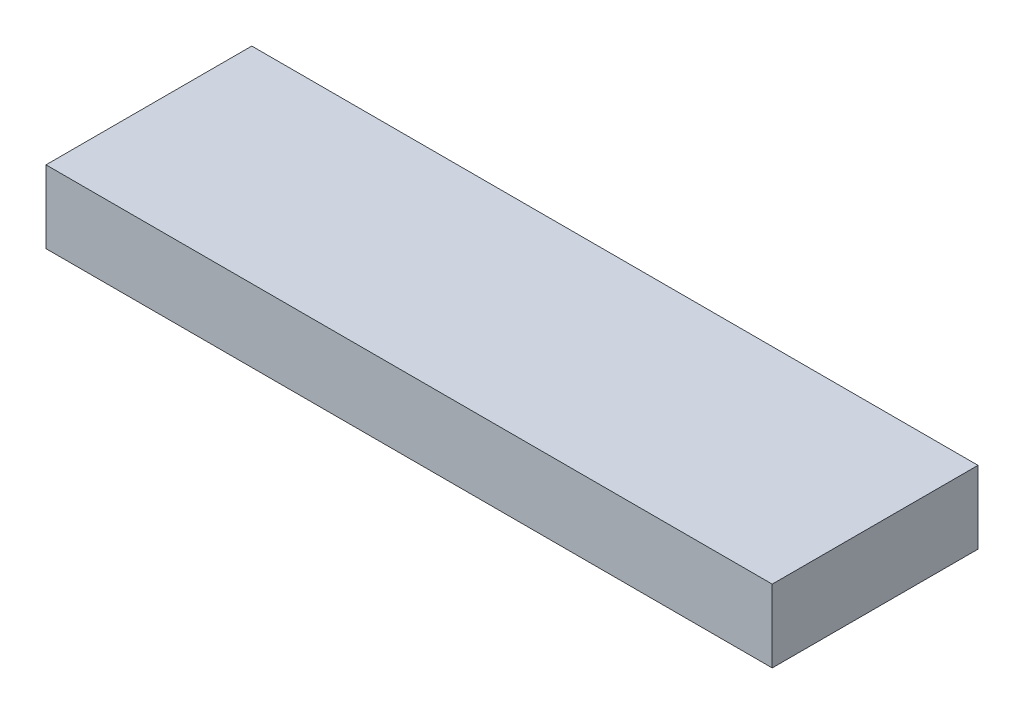
ISO-10303-21;
HEADER;
FILE_DESCRIPTION(('STEP AP214'),'2;1');
FILE_NAME('part.step','',(''),(''),'','','');
FILE_SCHEMA(('AUTOMOTIVE_DESIGN { 1 0 10303 214 1 1 1 1 }'));
ENDSEC;
DATA;
#1=APPLICATION_CONTEXT('core data for automotive mechanical design processes');
#2=APPLICATION_PROTOCOL_DEFINITION('international standard','automotive_design',2000,#1);
#3=PRODUCT_CONTEXT('',#1,'mechanical');
#4=PRODUCT('Part','Part','',(#3));
#5=PRODUCT_RELATED_PRODUCT_CATEGORY('part','',(#4));
#6=PRODUCT_DEFINITION_FORMATION('','',#4);
#7=PRODUCT_DEFINITION_CONTEXT('part definition',#1,'design');
#8=PRODUCT_DEFINITION('design','',#6,#7);
#9=PRODUCT_DEFINITION_SHAPE('','',#8);
#10=(LENGTH_UNIT() NAMED_UNIT(*) SI_UNIT(.MILLI.,.METRE.));
#11=(NAMED_UNIT(*) PLANE_ANGLE_UNIT() SI_UNIT($,.RADIAN.));
#12=(NAMED_UNIT(*) SI_UNIT($,.STERADIAN.) SOLID_ANGLE_UNIT());
#13=UNCERTAINTY_MEASURE_WITH_UNIT(LENGTH_MEASURE(1.E-05),#10,'distance_accuracy_value','');
#14=(GEOMETRIC_REPRESENTATION_CONTEXT(3) GLOBAL_UNCERTAINTY_ASSIGNED_CONTEXT((#13)) GLOBAL_UNIT_ASSIGNED_CONTEXT((#10,
#11,#12)) REPRESENTATION_CONTEXT('',''));
#15=CARTESIAN_POINT('',(0.,0.,0.));
#16=DIRECTION('',(0.,0.,1.));
#17=DIRECTION('',(1.,0.,0.));
#18=AXIS2_PLACEMENT_3D('',#15,#16,#17);
#19=CARTESIAN_POINT('',(0.,0.,0.));
#20=DIRECTION('',(0.,0.,-1.));
#21=DIRECTION('',(-1.,0.,0.));
#22=AXIS2_PLACEMENT_3D('',#19,#20,#21);
#23=PLANE('',#22);
#24=DIRECTION('',(0.,-1.,0.));
#25=VECTOR('',#24,1.);
#26=CARTESIAN_POINT('',(0.,0.,0.));
#27=LINE('',#26,#25);
#28=CARTESIAN_POINT('',(0.,0.06,0.));
#29=VERTEX_POINT('',#28);
#30=CARTESIAN_POINT('',(0.,0.,0.));
#31=VERTEX_POINT('',#30);
#32=EDGE_CURVE('E179',#29,#31,#27,.T.);
#33=ORIENTED_EDGE('',*,*,#32,.F.);
#34=DIRECTION('',(-1.,0.,0.));
#35=VECTOR('',#34,1.);
#36=CARTESIAN_POINT('',(0.,0.06,0.));
#37=LINE('',#36,#35);
#38=CARTESIAN_POINT('',(0.6,0.06,0.));
#39=VERTEX_POINT('',#38);
#40=EDGE_CURVE('E331',#39,#29,#37,.T.);
#41=ORIENTED_EDGE('',*,*,#40,.F.);
#42=DIRECTION('',(0.,1.,0.));
#43=VECTOR('',#42,1.);
#44=CARTESIAN_POINT('',(0.6,0.,0.));
#45=LINE('',#44,#43);
#46=CARTESIAN_POINT('',(0.6,0.,0.));
#47=VERTEX_POINT('',#46);
#48=EDGE_CURVE('E329',#47,#39,#45,.T.);
#49=ORIENTED_EDGE('',*,*,#48,.F.);
#50=DIRECTION('',(1.,0.,0.));
#51=VECTOR('',#50,1.);
#52=CARTESIAN_POINT('',(0.,0.,0.));
#53=LINE('',#52,#51);
#54=EDGE_CURVE('E327',#31,#47,#53,.T.);
#55=ORIENTED_EDGE('',*,*,#54,.F.);
#56=EDGE_LOOP('',(#33,#41,#49,#55));
#57=FACE_BOUND('',#56,.T.);
#58=DIRECTION('',(-1.,0.,0.));
#59=VECTOR('',#58,1.);
#60=CARTESIAN_POINT('',(0.0150695996096264,0.0450077471621841,0.));
#61=LINE('',#60,#59);
#62=CARTESIAN_POINT('',(0.116007256687764,0.0450077471621841,0.));
#63=VERTEX_POINT('',#62);
#64=CARTESIAN_POINT('',(0.0150695996096264,0.0450077471621841,0.));
#65=VERTEX_POINT('',#64);
#66=EDGE_CURVE('E297',#63,#65,#61,.T.);
#67=ORIENTED_EDGE('',*,*,#66,.T.);
#68=DIRECTION('',(0.,-1.,0.));
#69=VECTOR('',#68,1.);
#70=CARTESIAN_POINT('',(0.0150695996096264,0.0450077471621841,0.));
#71=LINE('',#70,#69);
#72=CARTESIAN_POINT('',(0.0150695996096264,0.0157641268872097,0.));
#73=VERTEX_POINT('',#72);
#74=EDGE_CURVE('E292',#65,#73,#71,.T.);
#75=ORIENTED_EDGE('',*,*,#74,.T.);
#76=DIRECTION('',(1.,0.,0.));
#77=VECTOR('',#76,1.);
#78=CARTESIAN_POINT('',(0.0150695996096264,0.0157641268872097,0.));
#79=LINE('',#78,#77);
#80=CARTESIAN_POINT('',(0.116007256687764,0.0157641268872097,0.));
#81=VERTEX_POINT('',#80);
#82=EDGE_CURVE('E309',#73,#81,#79,.T.);
#83=ORIENTED_EDGE('',*,*,#82,.T.);
#84=DIRECTION('',(0.,1.,0.));
#85=VECTOR('',#84,1.);
#86=CARTESIAN_POINT('',(0.116007256687764,0.0450077471621841,0.));
#87=LINE('',#86,#85);
#88=EDGE_CURVE('E312',#81,#63,#87,.T.);
#89=ORIENTED_EDGE('',*,*,#88,.T.);
#90=EDGE_LOOP('',(#67,#75,#83,#89));
#91=FACE_BOUND('',#90,.T.);
#92=DIRECTION('',(-1.,0.,0.));
#93=VECTOR('',#92,1.);
#94=CARTESIAN_POINT('',(0.153740960268376,0.0459510897516995,0.));
#95=LINE('',#94,#93);
#96=CARTESIAN_POINT('',(0.254678617346513,0.0459510897516995,0.));
#97=VERTEX_POINT('',#96);
#98=CARTESIAN_POINT('',(0.153740960268376,0.0459510897516995,0.));
#99=VERTEX_POINT('',#98);
#100=EDGE_CURVE('E263',#97,#99,#95,.T.);
#101=ORIENTED_EDGE('',*,*,#100,.T.);
#102=DIRECTION('',(0.,-1.,0.));
#103=VECTOR('',#102,1.);
#104=CARTESIAN_POINT('',(0.153740960268376,0.0459510897516995,0.));
#105=LINE('',#104,#103);
#106=CARTESIAN_POINT('',(0.153740960268376,0.016707469476725,0.));
#107=VERTEX_POINT('',#106);
#108=EDGE_CURVE('E258',#99,#107,#105,.T.);
#109=ORIENTED_EDGE('',*,*,#108,.T.);
#110=DIRECTION('',(1.,0.,0.));
#111=VECTOR('',#110,1.);
#112=CARTESIAN_POINT('',(0.153740960268376,0.016707469476725,0.));
#113=LINE('',#112,#111);
#114=CARTESIAN_POINT('',(0.254678617346513,0.016707469476725,0.));
#115=VERTEX_POINT('',#114);
#116=EDGE_CURVE('E275',#107,#115,#113,.T.);
#117=ORIENTED_EDGE('',*,*,#116,.T.);
#118=DIRECTION('',(0.,1.,0.));
#119=VECTOR('',#118,1.);
#120=CARTESIAN_POINT('',(0.254678617346513,0.0459510897516995,0.));
#121=LINE('',#120,#119);
#122=EDGE_CURVE('E278',#115,#97,#121,.T.);
#123=ORIENTED_EDGE('',*,*,#122,.T.);
#124=EDGE_LOOP('',(#101,#109,#117,#123));
#125=FACE_BOUND('',#124,.T.);
#126=DIRECTION('',(-1.,0.,0.));
#127=VECTOR('',#126,1.);
#128=CARTESIAN_POINT('',(0.341466135581921,0.0431210619831535,0.));
#129=LINE('',#128,#127);
#130=CARTESIAN_POINT('',(0.442403792660059,0.0431210619831535,0.));
#131=VERTEX_POINT('',#130);
#132=CARTESIAN_POINT('',(0.341466135581921,0.0431210619831535,0.));
#133=VERTEX_POINT('',#132);
#134=EDGE_CURVE('E232',#131,#133,#129,.T.);
#135=ORIENTED_EDGE('',*,*,#134,.T.);
#136=DIRECTION('',(0.,-1.,0.));
#137=VECTOR('',#136,1.);
#138=CARTESIAN_POINT('',(0.341466135581921,0.0431210619831535,0.));
#139=LINE('',#138,#137);
#140=CARTESIAN_POINT('',(0.341466135581921,0.0138774417081791,0.));
#141=VERTEX_POINT('',#140);
#142=EDGE_CURVE('E56',#133,#141,#139,.T.);
#143=ORIENTED_EDGE('',*,*,#142,.T.);
#144=DIRECTION('',(1.,0.,0.));
#145=VECTOR('',#144,1.);
#146=CARTESIAN_POINT('',(0.341466135581921,0.0138774417081791,0.));
#147=LINE('',#146,#145);
#148=CARTESIAN_POINT('',(0.442403792660059,0.0138774417081791,0.));
#149=VERTEX_POINT('',#148);
#150=EDGE_CURVE('E243',#141,#149,#147,.T.);
#151=ORIENTED_EDGE('',*,*,#150,.T.);
#152=DIRECTION('',(0.,1.,0.));
#153=VECTOR('',#152,1.);
#154=CARTESIAN_POINT('',(0.442403792660059,0.0431210619831535,0.));
#155=LINE('',#154,#153);
#156=EDGE_CURVE('E246',#149,#131,#155,.T.);
#157=ORIENTED_EDGE('',*,*,#156,.T.);
#158=EDGE_LOOP('',(#135,#143,#151,#157));
#159=FACE_BOUND('',#158,.T.);
#160=DIRECTION('',(-1.,0.,0.));
#161=VECTOR('',#160,1.);
#162=CARTESIAN_POINT('',(0.480137496240671,0.0440644045726689,0.));
#163=LINE('',#162,#161);
#164=CARTESIAN_POINT('',(0.581075153318808,0.0440644045726689,0.));
#165=VERTEX_POINT('',#164);
#166=CARTESIAN_POINT('',(0.480137496240671,0.0440644045726689,0.));
#167=VERTEX_POINT('',#166);
#168=EDGE_CURVE('E202',#165,#167,#163,.T.);
#169=ORIENTED_EDGE('',*,*,#168,.T.);
#170=DIRECTION('',(0.,-1.,0.));
#171=VECTOR('',#170,1.);
#172=CARTESIAN_POINT('',(0.480137496240671,0.0440644045726689,0.));
#173=LINE('',#172,#171);
#174=CARTESIAN_POINT('',(0.480137496240671,0.0148207842976945,0.));
#175=VERTEX_POINT('',#174);
#176=EDGE_CURVE('E48',#167,#175,#173,.T.);
#177=ORIENTED_EDGE('',*,*,#176,.T.);
#178=DIRECTION('',(1.,0.,0.));
#179=VECTOR('',#178,1.);
#180=CARTESIAN_POINT('',(0.480137496240671,0.0148207842976945,0.));
#181=LINE('',#180,#179);
#182=CARTESIAN_POINT('',(0.581075153318808,0.0148207842976945,0.));
#183=VERTEX_POINT('',#182);
#184=EDGE_CURVE('E213',#175,#183,#181,.T.);
#185=ORIENTED_EDGE('',*,*,#184,.T.);
#186=DIRECTION('',(0.,1.,0.));
#187=VECTOR('',#186,1.);
#188=CARTESIAN_POINT('',(0.581075153318808,0.0440644045726689,0.));
#189=LINE('',#188,#187);
#190=EDGE_CURVE('E216',#183,#165,#189,.T.);
#191=ORIENTED_EDGE('',*,*,#190,.T.);
#192=EDGE_LOOP('',(#169,#177,#185,#191));
#193=FACE_BOUND('',#192,.T.);
#194=ADVANCED_FACE('F33',(#57,#91,#125,#159,#193),#23,.T.);
#195=CARTESIAN_POINT('',(0.,0.,0.15));
#196=DIRECTION('',(1.,0.,0.));
#197=DIRECTION('',(0.,0.,-1.));
#198=AXIS2_PLACEMENT_3D('',#195,#196,#197);
#199=PLANE('',#198);
#200=ORIENTED_EDGE('',*,*,#32,.T.);
#201=DIRECTION('',(0.,0.,-1.));
#202=VECTOR('',#201,1.);
#203=CARTESIAN_POINT('',(0.,0.,0.15));
#204=LINE('',#203,#202);
#205=CARTESIAN_POINT('',(0.,0.,0.17));
#206=VERTEX_POINT('',#205);
#207=EDGE_CURVE('E11',#206,#31,#204,.T.);
#208=ORIENTED_EDGE('',*,*,#207,.F.);
#209=DIRECTION('',(0.,-1.,0.));
#210=VECTOR('',#209,1.);
#211=CARTESIAN_POINT('',(0.,0.06,0.17));
#212=LINE('',#211,#210);
#213=CARTESIAN_POINT('',(0.,0.06,0.17));
#214=VERTEX_POINT('',#213);
#215=EDGE_CURVE('E177',#214,#206,#212,.T.);
#216=ORIENTED_EDGE('',*,*,#215,.F.);
#217=DIRECTION('',(0.,0.,-1.));
#218=VECTOR('',#217,1.);
#219=CARTESIAN_POINT('',(0.,0.06,0.15));
#220=LINE('',#219,#218);
#221=EDGE_CURVE('E333',#214,#29,#220,.T.);
#222=ORIENTED_EDGE('',*,*,#221,.T.);
#223=EDGE_LOOP('',(#200,#208,#216,#222));
#224=FACE_BOUND('',#223,.T.);
#225=ADVANCED_FACE('F35',(#224),#199,.F.);
#226=CARTESIAN_POINT('',(0.,0.,0.15));
#227=DIRECTION('',(0.,1.,0.));
#228=DIRECTION('',(0.,0.,1.));
#229=AXIS2_PLACEMENT_3D('',#226,#227,#228);
#230=PLANE('',#229);
#231=ORIENTED_EDGE('',*,*,#54,.T.);
#232=DIRECTION('',(0.,0.,-1.));
#233=VECTOR('',#232,1.);
#234=CARTESIAN_POINT('',(0.6,0.,0.15));
#235=LINE('',#234,#233);
#236=CARTESIAN_POINT('',(0.6,0.,0.17));
#237=VERTEX_POINT('',#236);
#238=EDGE_CURVE('E41',#237,#47,#235,.T.);
#239=ORIENTED_EDGE('',*,*,#238,.F.);
#240=DIRECTION('',(1.,0.,0.));
#241=VECTOR('',#240,1.);
#242=CARTESIAN_POINT('',(0.,0.,0.17));
#243=LINE('',#242,#241);
#244=EDGE_CURVE('E182',#206,#237,#243,.T.);
#245=ORIENTED_EDGE('',*,*,#244,.F.);
#246=ORIENTED_EDGE('',*,*,#207,.T.);
#247=EDGE_LOOP('',(#231,#239,#245,#246));
#248=FACE_BOUND('',#247,.T.);
#249=ADVANCED_FACE('F183',(#248),#230,.F.);
#250=CARTESIAN_POINT('',(0.6,0.,0.15));
#251=DIRECTION('',(-1.,0.,0.));
#252=DIRECTION('',(0.,0.,1.));
#253=AXIS2_PLACEMENT_3D('',#250,#251,#252);
#254=PLANE('',#253);
#255=ORIENTED_EDGE('',*,*,#48,.T.);
#256=DIRECTION('',(0.,0.,-1.));
#257=VECTOR('',#256,1.);
#258=CARTESIAN_POINT('',(0.6,0.06,0.15));
#259=LINE('',#258,#257);
#260=CARTESIAN_POINT('',(0.6,0.06,0.17));
#261=VERTEX_POINT('',#260);
#262=EDGE_CURVE('E335',#261,#39,#259,.T.);
#263=ORIENTED_EDGE('',*,*,#262,.F.);
#264=DIRECTION('',(0.,1.,0.));
#265=VECTOR('',#264,1.);
#266=CARTESIAN_POINT('',(0.6,0.06,0.17));
#267=LINE('',#266,#265);
#268=EDGE_CURVE('E188',#237,#261,#267,.T.);
#269=ORIENTED_EDGE('',*,*,#268,.F.);
#270=ORIENTED_EDGE('',*,*,#238,.T.);
#271=EDGE_LOOP('',(#255,#263,#269,#270));
#272=FACE_BOUND('',#271,.T.);
#273=ADVANCED_FACE('F339',(#272),#254,.F.);
#274=CARTESIAN_POINT('',(0.,0.06,0.15));
#275=DIRECTION('',(0.,-1.,0.));
#276=DIRECTION('',(0.,0.,-1.));
#277=AXIS2_PLACEMENT_3D('',#274,#275,#276);
#278=PLANE('',#277);
#279=ORIENTED_EDGE('',*,*,#40,.T.);
#280=ORIENTED_EDGE('',*,*,#221,.F.);
#281=DIRECTION('',(-1.,0.,0.));
#282=VECTOR('',#281,1.);
#283=CARTESIAN_POINT('',(0.,0.06,0.17));
#284=LINE('',#283,#282);
#285=EDGE_CURVE('E193',#261,#214,#284,.T.);
#286=ORIENTED_EDGE('',*,*,#285,.F.);
#287=ORIENTED_EDGE('',*,*,#262,.T.);
#288=EDGE_LOOP('',(#279,#280,#286,#287));
#289=FACE_BOUND('',#288,.T.);
#290=ADVANCED_FACE('F344',(#289),#278,.F.);
#291=CARTESIAN_POINT('',(0.0150695996096264,0.0450077471621841,0.15));
#292=DIRECTION('',(1.,0.,0.));
#293=DIRECTION('',(0.,0.,-1.));
#294=AXIS2_PLACEMENT_3D('',#291,#292,#293);
#295=PLANE('',#294);
#296=ORIENTED_EDGE('',*,*,#74,.F.);
#297=DIRECTION('',(0.,0.,-1.));
#298=VECTOR('',#297,1.);
#299=CARTESIAN_POINT('',(0.0150695996096264,0.0450077471621841,0.15));
#300=LINE('',#299,#298);
#301=CARTESIAN_POINT('',(0.0150695996096264,0.0450077471621841,0.15));
#302=VERTEX_POINT('',#301);
#303=EDGE_CURVE('E306',#302,#65,#300,.T.);
#304=ORIENTED_EDGE('',*,*,#303,.F.);
#305=DIRECTION('',(0.,-1.,0.));
#306=VECTOR('',#305,1.);
#307=CARTESIAN_POINT('',(0.0150695996096264,0.0450077471621841,0.15));
#308=LINE('',#307,#306);
#309=CARTESIAN_POINT('',(0.0150695996096264,0.0157641268872097,0.15));
#310=VERTEX_POINT('',#309);
#311=EDGE_CURVE('E293',#302,#310,#308,.T.);
#312=ORIENTED_EDGE('',*,*,#311,.T.);
#313=DIRECTION('',(0.,0.,-1.));
#314=VECTOR('',#313,1.);
#315=CARTESIAN_POINT('',(0.0150695996096264,0.0157641268872097,0.15));
#316=LINE('',#315,#314);
#317=EDGE_CURVE('E323',#310,#73,#316,.T.);
#318=ORIENTED_EDGE('',*,*,#317,.T.);
#319=EDGE_LOOP('',(#296,#304,#312,#318));
#320=FACE_BOUND('',#319,.T.);
#321=ADVANCED_FACE('F346',(#320),#295,.T.);
#322=CARTESIAN_POINT('',(0.0150695996096264,0.0157641268872097,0.15));
#323=DIRECTION('',(0.,1.,0.));
#324=DIRECTION('',(0.,0.,1.));
#325=AXIS2_PLACEMENT_3D('',#322,#323,#324);
#326=PLANE('',#325);
#327=ORIENTED_EDGE('',*,*,#82,.F.);
#328=ORIENTED_EDGE('',*,*,#317,.F.);
#329=DIRECTION('',(1.,0.,0.));
#330=VECTOR('',#329,1.);
#331=CARTESIAN_POINT('',(0.0150695996096264,0.0157641268872097,0.15));
#332=LINE('',#331,#330);
#333=CARTESIAN_POINT('',(0.116007256687764,0.0157641268872097,0.15));
#334=VERTEX_POINT('',#333);
#335=EDGE_CURVE('E296',#310,#334,#332,.T.);
#336=ORIENTED_EDGE('',*,*,#335,.T.);
#337=DIRECTION('',(0.,0.,-1.));
#338=VECTOR('',#337,1.);
#339=CARTESIAN_POINT('',(0.116007256687764,0.0157641268872097,0.15));
#340=LINE('',#339,#338);
#341=EDGE_CURVE('E321',#334,#81,#340,.T.);
#342=ORIENTED_EDGE('',*,*,#341,.T.);
#343=EDGE_LOOP('',(#327,#328,#336,#342));
#344=FACE_BOUND('',#343,.T.);
#345=ADVANCED_FACE('F353',(#344),#326,.T.);
#346=CARTESIAN_POINT('',(0.116007256687764,0.0450077471621841,0.15));
#347=DIRECTION('',(-1.,0.,0.));
#348=DIRECTION('',(0.,0.,1.));
#349=AXIS2_PLACEMENT_3D('',#346,#347,#348);
#350=PLANE('',#349);
#351=ORIENTED_EDGE('',*,*,#88,.F.);
#352=ORIENTED_EDGE('',*,*,#341,.F.);
#353=DIRECTION('',(0.,1.,0.));
#354=VECTOR('',#353,1.);
#355=CARTESIAN_POINT('',(0.116007256687764,0.0450077471621841,0.15));
#356=LINE('',#355,#354);
#357=CARTESIAN_POINT('',(0.116007256687764,0.0450077471621841,0.15));
#358=VERTEX_POINT('',#357);
#359=EDGE_CURVE('E300',#334,#358,#356,.T.);
#360=ORIENTED_EDGE('',*,*,#359,.T.);
#361=DIRECTION('',(0.,0.,-1.));
#362=VECTOR('',#361,1.);
#363=CARTESIAN_POINT('',(0.116007256687764,0.0450077471621841,0.15));
#364=LINE('',#363,#362);
#365=EDGE_CURVE('E319',#358,#63,#364,.T.);
#366=ORIENTED_EDGE('',*,*,#365,.T.);
#367=EDGE_LOOP('',(#351,#352,#360,#366));
#368=FACE_BOUND('',#367,.T.);
#369=ADVANCED_FACE('F366',(#368),#350,.T.);
#370=CARTESIAN_POINT('',(0.0150695996096264,0.0450077471621841,0.15));
#371=DIRECTION('',(0.,-1.,0.));
#372=DIRECTION('',(0.,0.,-1.));
#373=AXIS2_PLACEMENT_3D('',#370,#371,#372);
#374=PLANE('',#373);
#375=ORIENTED_EDGE('',*,*,#66,.F.);
#376=ORIENTED_EDGE('',*,*,#365,.F.);
#377=DIRECTION('',(-1.,0.,0.));
#378=VECTOR('',#377,1.);
#379=CARTESIAN_POINT('',(0.0150695996096264,0.0450077471621841,0.15));
#380=LINE('',#379,#378);
#381=EDGE_CURVE('E303',#358,#302,#380,.T.);
#382=ORIENTED_EDGE('',*,*,#381,.T.);
#383=ORIENTED_EDGE('',*,*,#303,.T.);
#384=EDGE_LOOP('',(#375,#376,#382,#383));
#385=FACE_BOUND('',#384,.T.);
#386=ADVANCED_FACE('F370',(#385),#374,.T.);
#387=CARTESIAN_POINT('',(0.153740960268376,0.0459510897516995,0.15));
#388=DIRECTION('',(1.,0.,0.));
#389=DIRECTION('',(0.,0.,-1.));
#390=AXIS2_PLACEMENT_3D('',#387,#388,#389);
#391=PLANE('',#390);
#392=ORIENTED_EDGE('',*,*,#108,.F.);
#393=DIRECTION('',(0.,0.,-1.));
#394=VECTOR('',#393,1.);
#395=CARTESIAN_POINT('',(0.153740960268376,0.0459510897516995,0.15));
#396=LINE('',#395,#394);
#397=CARTESIAN_POINT('',(0.153740960268376,0.0459510897516995,0.15));
#398=VERTEX_POINT('',#397);
#399=EDGE_CURVE('E272',#398,#99,#396,.T.);
#400=ORIENTED_EDGE('',*,*,#399,.F.);
#401=DIRECTION('',(0.,-1.,0.));
#402=VECTOR('',#401,1.);
#403=CARTESIAN_POINT('',(0.153740960268376,0.0459510897516995,0.15));
#404=LINE('',#403,#402);
#405=CARTESIAN_POINT('',(0.153740960268376,0.016707469476725,0.15));
#406=VERTEX_POINT('',#405);
#407=EDGE_CURVE('E259',#398,#406,#404,.T.);
#408=ORIENTED_EDGE('',*,*,#407,.T.);
#409=DIRECTION('',(0.,0.,-1.));
#410=VECTOR('',#409,1.);
#411=CARTESIAN_POINT('',(0.153740960268376,0.016707469476725,0.15));
#412=LINE('',#411,#410);
#413=EDGE_CURVE('E289',#406,#107,#412,.T.);
#414=ORIENTED_EDGE('',*,*,#413,.T.);
#415=EDGE_LOOP('',(#392,#400,#408,#414));
#416=FACE_BOUND('',#415,.T.);
#417=ADVANCED_FACE('F374',(#416),#391,.T.);
#418=CARTESIAN_POINT('',(0.153740960268376,0.016707469476725,0.15));
#419=DIRECTION('',(0.,1.,0.));
#420=DIRECTION('',(0.,0.,1.));
#421=AXIS2_PLACEMENT_3D('',#418,#419,#420);
#422=PLANE('',#421);
#423=ORIENTED_EDGE('',*,*,#116,.F.);
#424=ORIENTED_EDGE('',*,*,#413,.F.);
#425=DIRECTION('',(1.,0.,0.));
#426=VECTOR('',#425,1.);
#427=CARTESIAN_POINT('',(0.153740960268376,0.016707469476725,0.15));
#428=LINE('',#427,#426);
#429=CARTESIAN_POINT('',(0.254678617346513,0.016707469476725,0.15));
#430=VERTEX_POINT('',#429);
#431=EDGE_CURVE('E262',#406,#430,#428,.T.);
#432=ORIENTED_EDGE('',*,*,#431,.T.);
#433=DIRECTION('',(0.,0.,-1.));
#434=VECTOR('',#433,1.);
#435=CARTESIAN_POINT('',(0.254678617346513,0.016707469476725,0.15));
#436=LINE('',#435,#434);
#437=EDGE_CURVE('E287',#430,#115,#436,.T.);
#438=ORIENTED_EDGE('',*,*,#437,.T.);
#439=EDGE_LOOP('',(#423,#424,#432,#438));
#440=FACE_BOUND('',#439,.T.);
#441=ADVANCED_FACE('F378',(#440),#422,.T.);
#442=CARTESIAN_POINT('',(0.254678617346513,0.0459510897516995,0.15));
#443=DIRECTION('',(-1.,0.,0.));
#444=DIRECTION('',(0.,0.,1.));
#445=AXIS2_PLACEMENT_3D('',#442,#443,#444);
#446=PLANE('',#445);
#447=ORIENTED_EDGE('',*,*,#122,.F.);
#448=ORIENTED_EDGE('',*,*,#437,.F.);
#449=DIRECTION('',(0.,1.,0.));
#450=VECTOR('',#449,1.);
#451=CARTESIAN_POINT('',(0.254678617346513,0.0459510897516995,0.15));
#452=LINE('',#451,#450);
#453=CARTESIAN_POINT('',(0.254678617346513,0.0459510897516995,0.15));
#454=VERTEX_POINT('',#453);
#455=EDGE_CURVE('E266',#430,#454,#452,.T.);
#456=ORIENTED_EDGE('',*,*,#455,.T.);
#457=DIRECTION('',(0.,0.,-1.));
#458=VECTOR('',#457,1.);
#459=CARTESIAN_POINT('',(0.254678617346513,0.0459510897516995,0.15));
#460=LINE('',#459,#458);
#461=EDGE_CURVE('E285',#454,#97,#460,.T.);
#462=ORIENTED_EDGE('',*,*,#461,.T.);
#463=EDGE_LOOP('',(#447,#448,#456,#462));
#464=FACE_BOUND('',#463,.T.);
#465=ADVANCED_FACE('F382',(#464),#446,.T.);
#466=CARTESIAN_POINT('',(0.153740960268376,0.0459510897516995,0.15));
#467=DIRECTION('',(0.,-1.,0.));
#468=DIRECTION('',(0.,0.,-1.));
#469=AXIS2_PLACEMENT_3D('',#466,#467,#468);
#470=PLANE('',#469);
#471=ORIENTED_EDGE('',*,*,#100,.F.);
#472=ORIENTED_EDGE('',*,*,#461,.F.);
#473=DIRECTION('',(-1.,0.,0.));
#474=VECTOR('',#473,1.);
#475=CARTESIAN_POINT('',(0.153740960268376,0.0459510897516995,0.15));
#476=LINE('',#475,#474);
#477=EDGE_CURVE('E269',#454,#398,#476,.T.);
#478=ORIENTED_EDGE('',*,*,#477,.T.);
#479=ORIENTED_EDGE('',*,*,#399,.T.);
#480=EDGE_LOOP('',(#471,#472,#478,#479));
#481=FACE_BOUND('',#480,.T.);
#482=ADVANCED_FACE('F386',(#481),#470,.T.);
#483=CARTESIAN_POINT('',(0.341466135581921,0.0431210619831535,0.15));
#484=DIRECTION('',(1.,0.,0.));
#485=DIRECTION('',(0.,0.,-1.));
#486=AXIS2_PLACEMENT_3D('',#483,#484,#485);
#487=PLANE('',#486);
#488=ORIENTED_EDGE('',*,*,#142,.F.);
#489=DIRECTION('',(0.,0.,-1.));
#490=VECTOR('',#489,1.);
#491=CARTESIAN_POINT('',(0.341466135581921,0.0431210619831535,0.15));
#492=LINE('',#491,#490);
#493=CARTESIAN_POINT('',(0.341466135581921,0.0431210619831535,0.15));
#494=VERTEX_POINT('',#493);
#495=EDGE_CURVE('E241',#494,#133,#492,.T.);
#496=ORIENTED_EDGE('',*,*,#495,.F.);
#497=DIRECTION('',(0.,-1.,0.));
#498=VECTOR('',#497,1.);
#499=CARTESIAN_POINT('',(0.341466135581921,0.0431210619831535,0.15));
#500=LINE('',#499,#498);
#501=CARTESIAN_POINT('',(0.341466135581921,0.0138774417081791,0.15));
#502=VERTEX_POINT('',#501);
#503=EDGE_CURVE('E228',#494,#502,#500,.T.);
#504=ORIENTED_EDGE('',*,*,#503,.T.);
#505=DIRECTION('',(0.,0.,-1.));
#506=VECTOR('',#505,1.);
#507=CARTESIAN_POINT('',(0.341466135581921,0.0138774417081791,0.15));
#508=LINE('',#507,#506);
#509=EDGE_CURVE('E256',#502,#141,#508,.T.);
#510=ORIENTED_EDGE('',*,*,#509,.T.);
#511=EDGE_LOOP('',(#488,#496,#504,#510));
#512=FACE_BOUND('',#511,.T.);
#513=ADVANCED_FACE('F390',(#512),#487,.T.);
#514=CARTESIAN_POINT('',(0.341466135581921,0.0138774417081791,0.15));
#515=DIRECTION('',(0.,1.,0.));
#516=DIRECTION('',(0.,0.,1.));
#517=AXIS2_PLACEMENT_3D('',#514,#515,#516);
#518=PLANE('',#517);
#519=ORIENTED_EDGE('',*,*,#150,.F.);
#520=ORIENTED_EDGE('',*,*,#509,.F.);
#521=DIRECTION('',(1.,0.,0.));
#522=VECTOR('',#521,1.);
#523=CARTESIAN_POINT('',(0.341466135581921,0.0138774417081791,0.15));
#524=LINE('',#523,#522);
#525=CARTESIAN_POINT('',(0.442403792660059,0.0138774417081791,0.15));
#526=VERTEX_POINT('',#525);
#527=EDGE_CURVE('E231',#502,#526,#524,.T.);
#528=ORIENTED_EDGE('',*,*,#527,.T.);
#529=DIRECTION('',(0.,0.,-1.));
#530=VECTOR('',#529,1.);
#531=CARTESIAN_POINT('',(0.442403792660059,0.0138774417081791,0.15));
#532=LINE('',#531,#530);
#533=EDGE_CURVE('E254',#526,#149,#532,.T.);
#534=ORIENTED_EDGE('',*,*,#533,.T.);
#535=EDGE_LOOP('',(#519,#520,#528,#534));
#536=FACE_BOUND('',#535,.T.);
#537=ADVANCED_FACE('F394',(#536),#518,.T.);
#538=CARTESIAN_POINT('',(0.442403792660059,0.0431210619831535,0.15));
#539=DIRECTION('',(-1.,0.,0.));
#540=DIRECTION('',(0.,0.,1.));
#541=AXIS2_PLACEMENT_3D('',#538,#539,#540);
#542=PLANE('',#541);
#543=ORIENTED_EDGE('',*,*,#156,.F.);
#544=ORIENTED_EDGE('',*,*,#533,.F.);
#545=DIRECTION('',(0.,1.,0.));
#546=VECTOR('',#545,1.);
#547=CARTESIAN_POINT('',(0.442403792660059,0.0431210619831535,0.15));
#548=LINE('',#547,#546);
#549=CARTESIAN_POINT('',(0.442403792660059,0.0431210619831535,0.15));
#550=VERTEX_POINT('',#549);
#551=EDGE_CURVE('E235',#526,#550,#548,.T.);
#552=ORIENTED_EDGE('',*,*,#551,.T.);
#553=DIRECTION('',(0.,0.,-1.));
#554=VECTOR('',#553,1.);
#555=CARTESIAN_POINT('',(0.442403792660059,0.0431210619831535,0.15));
#556=LINE('',#555,#554);
#557=EDGE_CURVE('E252',#550,#131,#556,.T.);
#558=ORIENTED_EDGE('',*,*,#557,.T.);
#559=EDGE_LOOP('',(#543,#544,#552,#558));
#560=FACE_BOUND('',#559,.T.);
#561=ADVANCED_FACE('F397',(#560),#542,.T.);
#562=CARTESIAN_POINT('',(0.341466135581921,0.0431210619831535,0.15));
#563=DIRECTION('',(0.,-1.,0.));
#564=DIRECTION('',(0.,0.,-1.));
#565=AXIS2_PLACEMENT_3D('',#562,#563,#564);
#566=PLANE('',#565);
#567=ORIENTED_EDGE('',*,*,#134,.F.);
#568=ORIENTED_EDGE('',*,*,#557,.F.);
#569=DIRECTION('',(-1.,0.,0.));
#570=VECTOR('',#569,1.);
#571=CARTESIAN_POINT('',(0.341466135581921,0.0431210619831535,0.15));
#572=LINE('',#571,#570);
#573=EDGE_CURVE('E238',#550,#494,#572,.T.);
#574=ORIENTED_EDGE('',*,*,#573,.T.);
#575=ORIENTED_EDGE('',*,*,#495,.T.);
#576=EDGE_LOOP('',(#567,#568,#574,#575));
#577=FACE_BOUND('',#576,.T.);
#578=ADVANCED_FACE('F401',(#577),#566,.T.);
#579=CARTESIAN_POINT('',(0.480137496240671,0.0440644045726689,0.15));
#580=DIRECTION('',(1.,0.,0.));
#581=DIRECTION('',(0.,0.,-1.));
#582=AXIS2_PLACEMENT_3D('',#579,#580,#581);
#583=PLANE('',#582);
#584=ORIENTED_EDGE('',*,*,#176,.F.);
#585=DIRECTION('',(0.,0.,-1.));
#586=VECTOR('',#585,1.);
#587=CARTESIAN_POINT('',(0.480137496240671,0.0440644045726689,0.15));
#588=LINE('',#587,#586);
#589=CARTESIAN_POINT('',(0.480137496240671,0.0440644045726689,0.15));
#590=VERTEX_POINT('',#589);
#591=EDGE_CURVE('E211',#590,#167,#588,.T.);
#592=ORIENTED_EDGE('',*,*,#591,.F.);
#593=DIRECTION('',(0.,-1.,0.));
#594=VECTOR('',#593,1.);
#595=CARTESIAN_POINT('',(0.480137496240671,0.0440644045726689,0.15));
#596=LINE('',#595,#594);
#597=CARTESIAN_POINT('',(0.480137496240671,0.0148207842976945,0.15));
#598=VERTEX_POINT('',#597);
#599=EDGE_CURVE('E198',#590,#598,#596,.T.);
#600=ORIENTED_EDGE('',*,*,#599,.T.);
#601=DIRECTION('',(0.,0.,-1.));
#602=VECTOR('',#601,1.);
#603=CARTESIAN_POINT('',(0.480137496240671,0.0148207842976945,0.15));
#604=LINE('',#603,#602);
#605=EDGE_CURVE('E226',#598,#175,#604,.T.);
#606=ORIENTED_EDGE('',*,*,#605,.T.);
#607=EDGE_LOOP('',(#584,#592,#600,#606));
#608=FACE_BOUND('',#607,.T.);
#609=ADVANCED_FACE('F405',(#608),#583,.T.);
#610=CARTESIAN_POINT('',(0.480137496240671,0.0148207842976945,0.15));
#611=DIRECTION('',(0.,1.,0.));
#612=DIRECTION('',(0.,0.,1.));
#613=AXIS2_PLACEMENT_3D('',#610,#611,#612);
#614=PLANE('',#613);
#615=ORIENTED_EDGE('',*,*,#184,.F.);
#616=ORIENTED_EDGE('',*,*,#605,.F.);
#617=DIRECTION('',(1.,0.,0.));
#618=VECTOR('',#617,1.);
#619=CARTESIAN_POINT('',(0.480137496240671,0.0148207842976945,0.15));
#620=LINE('',#619,#618);
#621=CARTESIAN_POINT('',(0.581075153318808,0.0148207842976945,0.15));
#622=VERTEX_POINT('',#621);
#623=EDGE_CURVE('E201',#598,#622,#620,.T.);
#624=ORIENTED_EDGE('',*,*,#623,.T.);
#625=DIRECTION('',(0.,0.,-1.));
#626=VECTOR('',#625,1.);
#627=CARTESIAN_POINT('',(0.581075153318808,0.0148207842976945,0.15));
#628=LINE('',#627,#626);
#629=EDGE_CURVE('E224',#622,#183,#628,.T.);
#630=ORIENTED_EDGE('',*,*,#629,.T.);
#631=EDGE_LOOP('',(#615,#616,#624,#630));
#632=FACE_BOUND('',#631,.T.);
#633=ADVANCED_FACE('F409',(#632),#614,.T.);
#634=CARTESIAN_POINT('',(0.581075153318808,0.0440644045726689,0.15));
#635=DIRECTION('',(-1.,0.,0.));
#636=DIRECTION('',(0.,0.,1.));
#637=AXIS2_PLACEMENT_3D('',#634,#635,#636);
#638=PLANE('',#637);
#639=ORIENTED_EDGE('',*,*,#190,.F.);
#640=ORIENTED_EDGE('',*,*,#629,.F.);
#641=DIRECTION('',(0.,1.,0.));
#642=VECTOR('',#641,1.);
#643=CARTESIAN_POINT('',(0.581075153318808,0.0440644045726689,0.15));
#644=LINE('',#643,#642);
#645=CARTESIAN_POINT('',(0.581075153318808,0.0440644045726689,0.15));
#646=VERTEX_POINT('',#645);
#647=EDGE_CURVE('E205',#622,#646,#644,.T.);
#648=ORIENTED_EDGE('',*,*,#647,.T.);
#649=DIRECTION('',(0.,0.,-1.));
#650=VECTOR('',#649,1.);
#651=CARTESIAN_POINT('',(0.581075153318808,0.0440644045726689,0.15));
#652=LINE('',#651,#650);
#653=EDGE_CURVE('E222',#646,#165,#652,.T.);
#654=ORIENTED_EDGE('',*,*,#653,.T.);
#655=EDGE_LOOP('',(#639,#640,#648,#654));
#656=FACE_BOUND('',#655,.T.);
#657=ADVANCED_FACE('F412',(#656),#638,.T.);
#658=CARTESIAN_POINT('',(0.480137496240671,0.0440644045726689,0.15));
#659=DIRECTION('',(0.,-1.,0.));
#660=DIRECTION('',(0.,0.,-1.));
#661=AXIS2_PLACEMENT_3D('',#658,#659,#660);
#662=PLANE('',#661);
#663=ORIENTED_EDGE('',*,*,#168,.F.);
#664=ORIENTED_EDGE('',*,*,#653,.F.);
#665=DIRECTION('',(-1.,0.,0.));
#666=VECTOR('',#665,1.);
#667=CARTESIAN_POINT('',(0.480137496240671,0.0440644045726689,0.15));
#668=LINE('',#667,#666);
#669=EDGE_CURVE('E208',#646,#590,#668,.T.);
#670=ORIENTED_EDGE('',*,*,#669,.T.);
#671=ORIENTED_EDGE('',*,*,#591,.T.);
#672=EDGE_LOOP('',(#663,#664,#670,#671));
#673=FACE_BOUND('',#672,.T.);
#674=ADVANCED_FACE('F416',(#673),#662,.T.);
#675=CARTESIAN_POINT('',(0.,0.,0.15));
#676=DIRECTION('',(0.,0.,1.));
#677=DIRECTION('',(1.,0.,0.));
#678=AXIS2_PLACEMENT_3D('',#675,#676,#677);
#679=PLANE('',#678);
#680=ORIENTED_EDGE('',*,*,#599,.F.);
#681=ORIENTED_EDGE('',*,*,#669,.F.);
#682=ORIENTED_EDGE('',*,*,#647,.F.);
#683=ORIENTED_EDGE('',*,*,#623,.F.);
#684=EDGE_LOOP('',(#680,#681,#682,#683));
#685=FACE_BOUND('',#684,.T.);
#686=ADVANCED_FACE('F420',(#685),#679,.F.);
#687=ORIENTED_EDGE('',*,*,#407,.F.);
#688=ORIENTED_EDGE('',*,*,#477,.F.);
#689=ORIENTED_EDGE('',*,*,#455,.F.);
#690=ORIENTED_EDGE('',*,*,#431,.F.);
#691=EDGE_LOOP('',(#687,#688,#689,#690));
#692=FACE_BOUND('',#691,.T.);
#693=ADVANCED_FACE('F423',(#692),#679,.F.);
#694=ORIENTED_EDGE('',*,*,#311,.F.);
#695=ORIENTED_EDGE('',*,*,#381,.F.);
#696=ORIENTED_EDGE('',*,*,#359,.F.);
#697=ORIENTED_EDGE('',*,*,#335,.F.);
#698=EDGE_LOOP('',(#694,#695,#696,#697));
#699=FACE_BOUND('',#698,.T.);
#700=ADVANCED_FACE('F430',(#699),#679,.F.);
#701=ORIENTED_EDGE('',*,*,#503,.F.);
#702=ORIENTED_EDGE('',*,*,#573,.F.);
#703=ORIENTED_EDGE('',*,*,#551,.F.);
#704=ORIENTED_EDGE('',*,*,#527,.F.);
#705=EDGE_LOOP('',(#701,#702,#703,#704));
#706=FACE_BOUND('',#705,.T.);
#707=ADVANCED_FACE('F425',(#706),#679,.F.);
#708=CARTESIAN_POINT('',(0.,0.,0.17));
#709=DIRECTION('',(0.,0.,1.));
#710=DIRECTION('',(1.,0.,0.));
#711=AXIS2_PLACEMENT_3D('',#708,#709,#710);
#712=PLANE('',#711);
#713=ORIENTED_EDGE('',*,*,#215,.T.);
#714=ORIENTED_EDGE('',*,*,#244,.T.);
#715=ORIENTED_EDGE('',*,*,#268,.T.);
#716=ORIENTED_EDGE('',*,*,#285,.T.);
#717=EDGE_LOOP('',(#713,#714,#715,#716));
#718=FACE_BOUND('',#717,.T.);
#719=ADVANCED_FACE('F191',(#718),#712,.T.);
#720=CLOSED_SHELL('',(#194,#225,#249,#273,#290,#321,#345,#369,#386,#417,#441,#465,#482,#513,
#537,#561,#578,#609,#633,#657,#674,#686,#693,#700,#707,#719));
#721=MANIFOLD_SOLID_BREP('B2',#720);
#722=ADVANCED_BREP_SHAPE_REPRESENTATION('',(#18,#721),#14);
#723=SHAPE_DEFINITION_REPRESENTATION(#9,#722);
ENDSEC;
END-ISO-10303-21;
